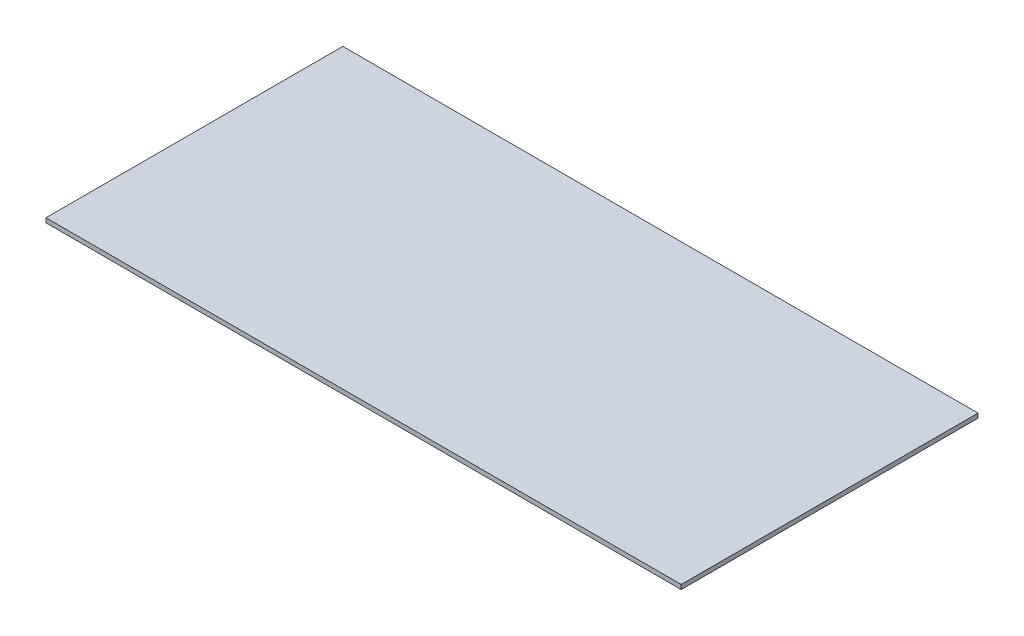
ISO-10303-21;
HEADER;
FILE_DESCRIPTION(('STEP AP214'),'2;1');
FILE_NAME('part.step','',(''),(''),'','','');
FILE_SCHEMA(('AUTOMOTIVE_DESIGN { 1 0 10303 214 1 1 1 1 }'));
ENDSEC;
DATA;
#1=APPLICATION_CONTEXT('core data for automotive mechanical design processes');
#2=APPLICATION_PROTOCOL_DEFINITION('international standard','automotive_design',2000,#1);
#3=PRODUCT_CONTEXT('',#1,'mechanical');
#4=PRODUCT('Part','Part','',(#3));
#5=PRODUCT_RELATED_PRODUCT_CATEGORY('part','',(#4));
#6=PRODUCT_DEFINITION_FORMATION('','',#4);
#7=PRODUCT_DEFINITION_CONTEXT('part definition',#1,'design');
#8=PRODUCT_DEFINITION('design','',#6,#7);
#9=PRODUCT_DEFINITION_SHAPE('','',#8);
#10=(LENGTH_UNIT() NAMED_UNIT(*) SI_UNIT(.MILLI.,.METRE.));
#11=(NAMED_UNIT(*) PLANE_ANGLE_UNIT() SI_UNIT($,.RADIAN.));
#12=(NAMED_UNIT(*) SI_UNIT($,.STERADIAN.) SOLID_ANGLE_UNIT());
#13=UNCERTAINTY_MEASURE_WITH_UNIT(LENGTH_MEASURE(1.E-05),#10,'distance_accuracy_value','');
#14=(GEOMETRIC_REPRESENTATION_CONTEXT(3) GLOBAL_UNCERTAINTY_ASSIGNED_CONTEXT((#13)) GLOBAL_UNIT_ASSIGNED_CONTEXT((#10,
#11,#12)) REPRESENTATION_CONTEXT('',''));
#15=CARTESIAN_POINT('',(0.,0.,0.));
#16=DIRECTION('',(0.,0.,1.));
#17=DIRECTION('',(1.,0.,0.));
#18=AXIS2_PLACEMENT_3D('',#15,#16,#17);
#19=CARTESIAN_POINT('',(-214.,3.,-105.));
#20=DIRECTION('',(1.,0.,0.));
#21=DIRECTION('',(0.,0.,-1.));
#22=AXIS2_PLACEMENT_3D('',#19,#20,#21);
#23=PLANE('',#22);
#24=DIRECTION('',(0.,0.,1.));
#25=VECTOR('',#24,1.);
#26=CARTESIAN_POINT('',(-214.,0.,-105.));
#27=LINE('',#26,#25);
#28=CARTESIAN_POINT('',(-214.,0.,-105.));
#29=VERTEX_POINT('',#28);
#30=CARTESIAN_POINT('',(-214.,0.,95.));
#31=VERTEX_POINT('',#30);
#32=EDGE_CURVE('E96',#29,#31,#27,.T.);
#33=ORIENTED_EDGE('',*,*,#32,.T.);
#34=DIRECTION('',(0.,-1.,0.));
#35=VECTOR('',#34,1.);
#36=CARTESIAN_POINT('',(-214.,3.,95.));
#37=LINE('',#36,#35);
#38=CARTESIAN_POINT('',(-214.,3.,95.));
#39=VERTEX_POINT('',#38);
#40=EDGE_CURVE('E11',#39,#31,#37,.T.);
#41=ORIENTED_EDGE('',*,*,#40,.F.);
#42=DIRECTION('',(0.,0.,1.));
#43=VECTOR('',#42,1.);
#44=CARTESIAN_POINT('',(-214.,3.,-105.));
#45=LINE('',#44,#43);
#46=CARTESIAN_POINT('',(-214.,3.,-105.));
#47=VERTEX_POINT('',#46);
#48=EDGE_CURVE('E84',#47,#39,#45,.T.);
#49=ORIENTED_EDGE('',*,*,#48,.F.);
#50=DIRECTION('',(0.,-1.,0.));
#51=VECTOR('',#50,1.);
#52=CARTESIAN_POINT('',(-214.,3.,-105.));
#53=LINE('',#52,#51);
#54=EDGE_CURVE('E92',#47,#29,#53,.T.);
#55=ORIENTED_EDGE('',*,*,#54,.T.);
#56=EDGE_LOOP('',(#33,#41,#49,#55));
#57=FACE_BOUND('',#56,.T.);
#58=ADVANCED_FACE('F33',(#57),#23,.F.);
#59=CARTESIAN_POINT('',(-214.,3.,95.));
#60=DIRECTION('',(0.,0.,-1.));
#61=DIRECTION('',(-1.,0.,0.));
#62=AXIS2_PLACEMENT_3D('',#59,#60,#61);
#63=PLANE('',#62);
#64=DIRECTION('',(1.,0.,0.));
#65=VECTOR('',#64,1.);
#66=CARTESIAN_POINT('',(-214.,0.,95.));
#67=LINE('',#66,#65);
#68=CARTESIAN_POINT('',(214.,0.,95.));
#69=VERTEX_POINT('',#68);
#70=EDGE_CURVE('E88',#31,#69,#67,.T.);
#71=ORIENTED_EDGE('',*,*,#70,.T.);
#72=DIRECTION('',(0.,-1.,0.));
#73=VECTOR('',#72,1.);
#74=CARTESIAN_POINT('',(214.,3.,95.));
#75=LINE('',#74,#73);
#76=CARTESIAN_POINT('',(214.,3.,95.));
#77=VERTEX_POINT('',#76);
#78=EDGE_CURVE('E41',#77,#69,#75,.T.);
#79=ORIENTED_EDGE('',*,*,#78,.F.);
#80=DIRECTION('',(1.,0.,0.));
#81=VECTOR('',#80,1.);
#82=CARTESIAN_POINT('',(-214.,3.,95.));
#83=LINE('',#82,#81);
#84=EDGE_CURVE('E79',#39,#77,#83,.T.);
#85=ORIENTED_EDGE('',*,*,#84,.F.);
#86=ORIENTED_EDGE('',*,*,#40,.T.);
#87=EDGE_LOOP('',(#71,#79,#85,#86));
#88=FACE_BOUND('',#87,.T.);
#89=ADVANCED_FACE('F87',(#88),#63,.F.);
#90=CARTESIAN_POINT('',(214.,3.,-105.));
#91=DIRECTION('',(-1.,0.,0.));
#92=DIRECTION('',(0.,0.,1.));
#93=AXIS2_PLACEMENT_3D('',#90,#91,#92);
#94=PLANE('',#93);
#95=DIRECTION('',(0.,0.,-1.));
#96=VECTOR('',#95,1.);
#97=CARTESIAN_POINT('',(214.,0.,-105.));
#98=LINE('',#97,#96);
#99=CARTESIAN_POINT('',(214.,0.,-105.));
#100=VERTEX_POINT('',#99);
#101=EDGE_CURVE('E66',#69,#100,#98,.T.);
#102=ORIENTED_EDGE('',*,*,#101,.T.);
#103=DIRECTION('',(0.,-1.,0.));
#104=VECTOR('',#103,1.);
#105=CARTESIAN_POINT('',(214.,3.,-105.));
#106=LINE('',#105,#104);
#107=CARTESIAN_POINT('',(214.,3.,-105.));
#108=VERTEX_POINT('',#107);
#109=EDGE_CURVE('E89',#108,#100,#106,.T.);
#110=ORIENTED_EDGE('',*,*,#109,.F.);
#111=DIRECTION('',(0.,0.,-1.));
#112=VECTOR('',#111,1.);
#113=CARTESIAN_POINT('',(214.,3.,-105.));
#114=LINE('',#113,#112);
#115=EDGE_CURVE('E82',#77,#108,#114,.T.);
#116=ORIENTED_EDGE('',*,*,#115,.F.);
#117=ORIENTED_EDGE('',*,*,#78,.T.);
#118=EDGE_LOOP('',(#102,#110,#116,#117));
#119=FACE_BOUND('',#118,.T.);
#120=ADVANCED_FACE('F90',(#119),#94,.F.);
#121=CARTESIAN_POINT('',(-214.,3.,-105.));
#122=DIRECTION('',(0.,0.,1.));
#123=DIRECTION('',(1.,0.,0.));
#124=AXIS2_PLACEMENT_3D('',#121,#122,#123);
#125=PLANE('',#124);
#126=DIRECTION('',(-1.,0.,0.));
#127=VECTOR('',#126,1.);
#128=CARTESIAN_POINT('',(-214.,0.,-105.));
#129=LINE('',#128,#127);
#130=EDGE_CURVE('E72',#100,#29,#129,.T.);
#131=ORIENTED_EDGE('',*,*,#130,.T.);
#132=ORIENTED_EDGE('',*,*,#54,.F.);
#133=DIRECTION('',(-1.,0.,0.));
#134=VECTOR('',#133,1.);
#135=CARTESIAN_POINT('',(-214.,3.,-105.));
#136=LINE('',#135,#134);
#137=EDGE_CURVE('E49',#108,#47,#136,.T.);
#138=ORIENTED_EDGE('',*,*,#137,.F.);
#139=ORIENTED_EDGE('',*,*,#109,.T.);
#140=EDGE_LOOP('',(#131,#132,#138,#139));
#141=FACE_BOUND('',#140,.T.);
#142=ADVANCED_FACE('F103',(#141),#125,.F.);
#143=CARTESIAN_POINT('',(0.,3.,0.));
#144=DIRECTION('',(0.,1.,0.));
#145=DIRECTION('',(0.,0.,1.));
#146=AXIS2_PLACEMENT_3D('',#143,#144,#145);
#147=PLANE('',#146);
#148=ORIENTED_EDGE('',*,*,#48,.T.);
#149=ORIENTED_EDGE('',*,*,#84,.T.);
#150=ORIENTED_EDGE('',*,*,#115,.T.);
#151=ORIENTED_EDGE('',*,*,#137,.T.);
#152=EDGE_LOOP('',(#148,#149,#150,#151));
#153=FACE_BOUND('',#152,.T.);
#154=ADVANCED_FACE('F80',(#153),#147,.T.);
#155=CARTESIAN_POINT('',(0.,0.,0.));
#156=DIRECTION('',(0.,1.,0.));
#157=DIRECTION('',(0.,0.,1.));
#158=AXIS2_PLACEMENT_3D('',#155,#156,#157);
#159=PLANE('',#158);
#160=ORIENTED_EDGE('',*,*,#32,.F.);
#161=ORIENTED_EDGE('',*,*,#130,.F.);
#162=ORIENTED_EDGE('',*,*,#101,.F.);
#163=ORIENTED_EDGE('',*,*,#70,.F.);
#164=EDGE_LOOP('',(#160,#161,#162,#163));
#165=FACE_BOUND('',#164,.T.);
#166=ADVANCED_FACE('F106',(#165),#159,.F.);
#167=CLOSED_SHELL('',(#58,#89,#120,#142,#154,#166));
#168=MANIFOLD_SOLID_BREP('B2',#167);
#169=ADVANCED_BREP_SHAPE_REPRESENTATION('',(#18,#168),#14);
#170=SHAPE_DEFINITION_REPRESENTATION(#9,#169);
ENDSEC;
END-ISO-10303-21;
